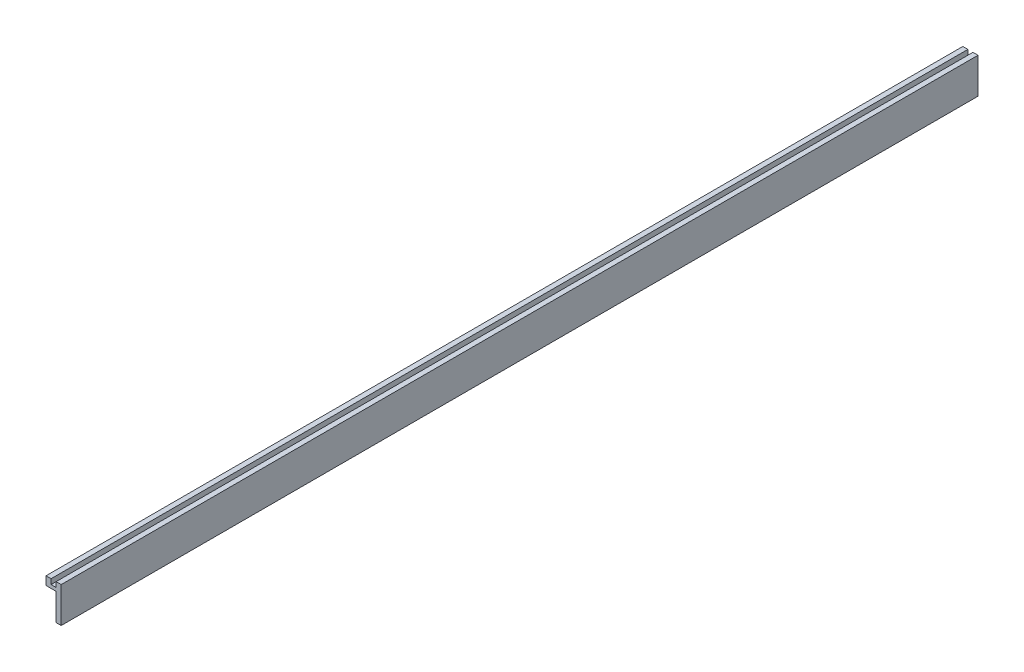
ISO-10303-21;
HEADER;
FILE_DESCRIPTION(('STEP AP214'),'2;1');
FILE_NAME('part.step','',(''),(''),'','','');
FILE_SCHEMA(('AUTOMOTIVE_DESIGN { 1 0 10303 214 1 1 1 1 }'));
ENDSEC;
DATA;
#1=APPLICATION_CONTEXT('core data for automotive mechanical design processes');
#2=APPLICATION_PROTOCOL_DEFINITION('international standard','automotive_design',2000,#1);
#3=PRODUCT_CONTEXT('',#1,'mechanical');
#4=PRODUCT('Part','Part','',(#3));
#5=PRODUCT_RELATED_PRODUCT_CATEGORY('part','',(#4));
#6=PRODUCT_DEFINITION_FORMATION('','',#4);
#7=PRODUCT_DEFINITION_CONTEXT('part definition',#1,'design');
#8=PRODUCT_DEFINITION('design','',#6,#7);
#9=PRODUCT_DEFINITION_SHAPE('','',#8);
#10=(LENGTH_UNIT() NAMED_UNIT(*) SI_UNIT(.MILLI.,.METRE.));
#11=(NAMED_UNIT(*) PLANE_ANGLE_UNIT() SI_UNIT($,.RADIAN.));
#12=(NAMED_UNIT(*) SI_UNIT($,.STERADIAN.) SOLID_ANGLE_UNIT());
#13=UNCERTAINTY_MEASURE_WITH_UNIT(LENGTH_MEASURE(1.E-05),#10,'distance_accuracy_value','');
#14=(GEOMETRIC_REPRESENTATION_CONTEXT(3) GLOBAL_UNCERTAINTY_ASSIGNED_CONTEXT((#13)) GLOBAL_UNIT_ASSIGNED_CONTEXT((#10,
#11,#12)) REPRESENTATION_CONTEXT('',''));
#15=CARTESIAN_POINT('',(0.,0.,0.));
#16=DIRECTION('',(0.,0.,1.));
#17=DIRECTION('',(1.,0.,0.));
#18=AXIS2_PLACEMENT_3D('',#15,#16,#17);
#19=CARTESIAN_POINT('',(0.,0.,904.));
#20=DIRECTION('',(0.,1.,0.));
#21=DIRECTION('',(0.,0.,1.));
#22=AXIS2_PLACEMENT_3D('',#19,#20,#21);
#23=PLANE('',#22);
#24=DIRECTION('',(0.,0.,1.));
#25=VECTOR('',#24,1.);
#26=CARTESIAN_POINT('',(10.,0.,0.));
#27=LINE('',#26,#25);
#28=CARTESIAN_POINT('',(10.,0.,0.));
#29=VERTEX_POINT('',#28);
#30=CARTESIAN_POINT('',(10.,0.,904.));
#31=VERTEX_POINT('',#30);
#32=EDGE_CURVE('E235',#29,#31,#27,.T.);
#33=ORIENTED_EDGE('',*,*,#32,.F.);
#34=DIRECTION('',(1.,0.,0.));
#35=VECTOR('',#34,1.);
#36=CARTESIAN_POINT('',(0.,0.,0.));
#37=LINE('',#36,#35);
#38=CARTESIAN_POINT('',(15.,0.,0.));
#39=VERTEX_POINT('',#38);
#40=EDGE_CURVE('E158',#29,#39,#37,.T.);
#41=ORIENTED_EDGE('',*,*,#40,.T.);
#42=DIRECTION('',(0.,0.,-1.));
#43=VECTOR('',#42,1.);
#44=CARTESIAN_POINT('',(15.,0.,904.));
#45=LINE('',#44,#43);
#46=CARTESIAN_POINT('',(15.,0.,904.));
#47=VERTEX_POINT('',#46);
#48=EDGE_CURVE('E11',#47,#39,#45,.T.);
#49=ORIENTED_EDGE('',*,*,#48,.F.);
#50=DIRECTION('',(1.,0.,0.));
#51=VECTOR('',#50,1.);
#52=CARTESIAN_POINT('',(0.,0.,904.));
#53=LINE('',#52,#51);
#54=EDGE_CURVE('E108',#31,#47,#53,.T.);
#55=ORIENTED_EDGE('',*,*,#54,.F.);
#56=EDGE_LOOP('',(#33,#41,#49,#55));
#57=FACE_BOUND('',#56,.T.);
#58=ADVANCED_FACE('F45',(#57),#23,.F.);
#59=CARTESIAN_POINT('',(0.,0.,904.));
#60=DIRECTION('',(1.,0.,0.));
#61=DIRECTION('',(0.,0.,-1.));
#62=AXIS2_PLACEMENT_3D('',#59,#60,#61);
#63=PLANE('',#62);
#64=DIRECTION('',(0.,-1.,0.));
#65=VECTOR('',#64,1.);
#66=CARTESIAN_POINT('',(0.,0.,0.));
#67=LINE('',#66,#65);
#68=CARTESIAN_POINT('',(0.,35.,0.));
#69=VERTEX_POINT('',#68);
#70=CARTESIAN_POINT('',(0.,26.6744169741884,0.));
#71=VERTEX_POINT('',#70);
#72=EDGE_CURVE('E154',#69,#71,#67,.T.);
#73=ORIENTED_EDGE('',*,*,#72,.T.);
#74=DIRECTION('',(0.,0.,-1.));
#75=VECTOR('',#74,1.);
#76=CARTESIAN_POINT('',(0.,26.6744169741884,0.));
#77=LINE('',#76,#75);
#78=CARTESIAN_POINT('',(0.,26.6744169741884,904.));
#79=VERTEX_POINT('',#78);
#80=EDGE_CURVE('E224',#79,#71,#77,.T.);
#81=ORIENTED_EDGE('',*,*,#80,.F.);
#82=DIRECTION('',(0.,-1.,0.));
#83=VECTOR('',#82,1.);
#84=CARTESIAN_POINT('',(0.,0.,904.));
#85=LINE('',#84,#83);
#86=CARTESIAN_POINT('',(0.,35.,904.));
#87=VERTEX_POINT('',#86);
#88=EDGE_CURVE('E178',#87,#79,#85,.T.);
#89=ORIENTED_EDGE('',*,*,#88,.F.);
#90=DIRECTION('',(0.,0.,-1.));
#91=VECTOR('',#90,1.);
#92=CARTESIAN_POINT('',(0.,35.,904.));
#93=LINE('',#92,#91);
#94=EDGE_CURVE('E150',#87,#69,#93,.T.);
#95=ORIENTED_EDGE('',*,*,#94,.T.);
#96=EDGE_LOOP('',(#73,#81,#89,#95));
#97=FACE_BOUND('',#96,.T.);
#98=ADVANCED_FACE('F47',(#97),#63,.F.);
#99=CARTESIAN_POINT('',(15.,0.,904.));
#100=DIRECTION('',(-1.,0.,0.));
#101=DIRECTION('',(0.,0.,1.));
#102=AXIS2_PLACEMENT_3D('',#99,#100,#101);
#103=PLANE('',#102);
#104=DIRECTION('',(0.,1.,0.));
#105=VECTOR('',#104,1.);
#106=CARTESIAN_POINT('',(15.,0.,0.));
#107=LINE('',#106,#105);
#108=CARTESIAN_POINT('',(15.,35.,0.));
#109=VERTEX_POINT('',#108);
#110=EDGE_CURVE('E162',#39,#109,#107,.T.);
#111=ORIENTED_EDGE('',*,*,#110,.T.);
#112=DIRECTION('',(0.,0.,-1.));
#113=VECTOR('',#112,1.);
#114=CARTESIAN_POINT('',(15.,35.,904.));
#115=LINE('',#114,#113);
#116=CARTESIAN_POINT('',(15.,35.,904.));
#117=VERTEX_POINT('',#116);
#118=EDGE_CURVE('E54',#117,#109,#115,.T.);
#119=ORIENTED_EDGE('',*,*,#118,.F.);
#120=DIRECTION('',(0.,1.,0.));
#121=VECTOR('',#120,1.);
#122=CARTESIAN_POINT('',(15.,0.,904.));
#123=LINE('',#122,#121);
#124=EDGE_CURVE('E209',#47,#117,#123,.T.);
#125=ORIENTED_EDGE('',*,*,#124,.F.);
#126=ORIENTED_EDGE('',*,*,#48,.T.);
#127=EDGE_LOOP('',(#111,#119,#125,#126));
#128=FACE_BOUND('',#127,.T.);
#129=ADVANCED_FACE('F290',(#128),#103,.F.);
#130=CARTESIAN_POINT('',(10.,35.,904.));
#131=DIRECTION('',(0.,-1.,0.));
#132=DIRECTION('',(0.,0.,-1.));
#133=AXIS2_PLACEMENT_3D('',#130,#131,#132);
#134=PLANE('',#133);
#135=DIRECTION('',(-1.,0.,0.));
#136=VECTOR('',#135,1.);
#137=CARTESIAN_POINT('',(10.,35.,0.));
#138=LINE('',#137,#136);
#139=CARTESIAN_POINT('',(10.,35.,0.));
#140=VERTEX_POINT('',#139);
#141=EDGE_CURVE('E165',#109,#140,#138,.T.);
#142=ORIENTED_EDGE('',*,*,#141,.T.);
#143=DIRECTION('',(0.,0.,-1.));
#144=VECTOR('',#143,1.);
#145=CARTESIAN_POINT('',(10.,35.,904.));
#146=LINE('',#145,#144);
#147=CARTESIAN_POINT('',(10.,35.,904.));
#148=VERTEX_POINT('',#147);
#149=EDGE_CURVE('E185',#148,#140,#146,.T.);
#150=ORIENTED_EDGE('',*,*,#149,.F.);
#151=DIRECTION('',(-1.,0.,0.));
#152=VECTOR('',#151,1.);
#153=CARTESIAN_POINT('',(10.,35.,904.));
#154=LINE('',#153,#152);
#155=EDGE_CURVE('E196',#117,#148,#154,.T.);
#156=ORIENTED_EDGE('',*,*,#155,.F.);
#157=ORIENTED_EDGE('',*,*,#118,.T.);
#158=EDGE_LOOP('',(#142,#150,#156,#157));
#159=FACE_BOUND('',#158,.T.);
#160=ADVANCED_FACE('F194',(#159),#134,.F.);
#161=CARTESIAN_POINT('',(10.,30.,904.));
#162=DIRECTION('',(1.,0.,0.));
#163=DIRECTION('',(0.,0.,-1.));
#164=AXIS2_PLACEMENT_3D('',#161,#162,#163);
#165=PLANE('',#164);
#166=DIRECTION('',(0.,-1.,0.));
#167=VECTOR('',#166,1.);
#168=CARTESIAN_POINT('',(10.,30.,0.));
#169=LINE('',#168,#167);
#170=CARTESIAN_POINT('',(10.,30.,0.));
#171=VERTEX_POINT('',#170);
#172=EDGE_CURVE('E168',#140,#171,#169,.T.);
#173=ORIENTED_EDGE('',*,*,#172,.T.);
#174=DIRECTION('',(0.,0.,-1.));
#175=VECTOR('',#174,1.);
#176=CARTESIAN_POINT('',(10.,30.,904.));
#177=LINE('',#176,#175);
#178=CARTESIAN_POINT('',(10.,30.,904.));
#179=VERTEX_POINT('',#178);
#180=EDGE_CURVE('E143',#179,#171,#177,.T.);
#181=ORIENTED_EDGE('',*,*,#180,.F.);
#182=DIRECTION('',(0.,-1.,0.));
#183=VECTOR('',#182,1.);
#184=CARTESIAN_POINT('',(10.,30.,904.));
#185=LINE('',#184,#183);
#186=EDGE_CURVE('E129',#148,#179,#185,.T.);
#187=ORIENTED_EDGE('',*,*,#186,.F.);
#188=ORIENTED_EDGE('',*,*,#149,.T.);
#189=EDGE_LOOP('',(#173,#181,#187,#188));
#190=FACE_BOUND('',#189,.T.);
#191=ADVANCED_FACE('F206',(#190),#165,.F.);
#192=CARTESIAN_POINT('',(5.,30.,904.));
#193=DIRECTION('',(0.,-1.,0.));
#194=DIRECTION('',(0.,0.,-1.));
#195=AXIS2_PLACEMENT_3D('',#192,#193,#194);
#196=PLANE('',#195);
#197=DIRECTION('',(-1.,0.,0.));
#198=VECTOR('',#197,1.);
#199=CARTESIAN_POINT('',(5.,30.,0.));
#200=LINE('',#199,#198);
#201=CARTESIAN_POINT('',(5.,30.,0.));
#202=VERTEX_POINT('',#201);
#203=EDGE_CURVE('E139',#171,#202,#200,.T.);
#204=ORIENTED_EDGE('',*,*,#203,.T.);
#205=DIRECTION('',(0.,0.,-1.));
#206=VECTOR('',#205,1.);
#207=CARTESIAN_POINT('',(5.,30.,904.));
#208=LINE('',#207,#206);
#209=CARTESIAN_POINT('',(5.,30.,904.));
#210=VERTEX_POINT('',#209);
#211=EDGE_CURVE('E136',#210,#202,#208,.T.);
#212=ORIENTED_EDGE('',*,*,#211,.F.);
#213=DIRECTION('',(-1.,0.,0.));
#214=VECTOR('',#213,1.);
#215=CARTESIAN_POINT('',(5.,30.,904.));
#216=LINE('',#215,#214);
#217=EDGE_CURVE('E122',#179,#210,#216,.T.);
#218=ORIENTED_EDGE('',*,*,#217,.F.);
#219=ORIENTED_EDGE('',*,*,#180,.T.);
#220=EDGE_LOOP('',(#204,#212,#218,#219));
#221=FACE_BOUND('',#220,.T.);
#222=ADVANCED_FACE('F137',(#221),#196,.F.);
#223=CARTESIAN_POINT('',(5.,35.,904.));
#224=DIRECTION('',(-1.,0.,0.));
#225=DIRECTION('',(0.,0.,1.));
#226=AXIS2_PLACEMENT_3D('',#223,#224,#225);
#227=PLANE('',#226);
#228=DIRECTION('',(0.,1.,0.));
#229=VECTOR('',#228,1.);
#230=CARTESIAN_POINT('',(5.,35.,0.));
#231=LINE('',#230,#229);
#232=CARTESIAN_POINT('',(5.,35.,0.));
#233=VERTEX_POINT('',#232);
#234=EDGE_CURVE('E173',#202,#233,#231,.T.);
#235=ORIENTED_EDGE('',*,*,#234,.T.);
#236=DIRECTION('',(0.,0.,-1.));
#237=VECTOR('',#236,1.);
#238=CARTESIAN_POINT('',(5.,35.,904.));
#239=LINE('',#238,#237);
#240=CARTESIAN_POINT('',(5.,35.,904.));
#241=VERTEX_POINT('',#240);
#242=EDGE_CURVE('E144',#241,#233,#239,.T.);
#243=ORIENTED_EDGE('',*,*,#242,.F.);
#244=DIRECTION('',(0.,1.,0.));
#245=VECTOR('',#244,1.);
#246=CARTESIAN_POINT('',(5.,35.,904.));
#247=LINE('',#246,#245);
#248=EDGE_CURVE('E126',#210,#241,#247,.T.);
#249=ORIENTED_EDGE('',*,*,#248,.F.);
#250=ORIENTED_EDGE('',*,*,#211,.T.);
#251=EDGE_LOOP('',(#235,#243,#249,#250));
#252=FACE_BOUND('',#251,.T.);
#253=ADVANCED_FACE('F146',(#252),#227,.F.);
#254=CARTESIAN_POINT('',(0.,35.,904.));
#255=DIRECTION('',(0.,-1.,0.));
#256=DIRECTION('',(0.,0.,-1.));
#257=AXIS2_PLACEMENT_3D('',#254,#255,#256);
#258=PLANE('',#257);
#259=DIRECTION('',(-1.,0.,0.));
#260=VECTOR('',#259,1.);
#261=CARTESIAN_POINT('',(0.,35.,0.));
#262=LINE('',#261,#260);
#263=EDGE_CURVE('E100',#233,#69,#262,.T.);
#264=ORIENTED_EDGE('',*,*,#263,.T.);
#265=ORIENTED_EDGE('',*,*,#94,.F.);
#266=DIRECTION('',(-1.,0.,0.));
#267=VECTOR('',#266,1.);
#268=CARTESIAN_POINT('',(0.,35.,904.));
#269=LINE('',#268,#267);
#270=EDGE_CURVE('E70',#241,#87,#269,.T.);
#271=ORIENTED_EDGE('',*,*,#270,.F.);
#272=ORIENTED_EDGE('',*,*,#242,.T.);
#273=EDGE_LOOP('',(#264,#265,#271,#272));
#274=FACE_BOUND('',#273,.T.);
#275=ADVANCED_FACE('F276',(#274),#258,.F.);
#276=CARTESIAN_POINT('',(0.,0.,904.));
#277=DIRECTION('',(0.,0.,-1.));
#278=DIRECTION('',(-1.,0.,0.));
#279=AXIS2_PLACEMENT_3D('',#276,#277,#278);
#280=PLANE('',#279);
#281=ORIENTED_EDGE('',*,*,#88,.T.);
#282=DIRECTION('',(-1.,0.,0.));
#283=VECTOR('',#282,1.);
#284=CARTESIAN_POINT('',(10.,26.6744169741884,904.));
#285=LINE('',#284,#283);
#286=CARTESIAN_POINT('',(10.,26.6744169741884,904.));
#287=VERTEX_POINT('',#286);
#288=EDGE_CURVE('E218',#287,#79,#285,.T.);
#289=ORIENTED_EDGE('',*,*,#288,.F.);
#290=DIRECTION('',(0.,1.,0.));
#291=VECTOR('',#290,1.);
#292=CARTESIAN_POINT('',(10.,26.6744169741884,904.));
#293=LINE('',#292,#291);
#294=EDGE_CURVE('E232',#31,#287,#293,.T.);
#295=ORIENTED_EDGE('',*,*,#294,.F.);
#296=ORIENTED_EDGE('',*,*,#54,.T.);
#297=ORIENTED_EDGE('',*,*,#124,.T.);
#298=ORIENTED_EDGE('',*,*,#155,.T.);
#299=ORIENTED_EDGE('',*,*,#186,.T.);
#300=ORIENTED_EDGE('',*,*,#217,.T.);
#301=ORIENTED_EDGE('',*,*,#248,.T.);
#302=ORIENTED_EDGE('',*,*,#270,.T.);
#303=EDGE_LOOP('',(#281,#289,#295,#296,#297,#298,#299,#300,#301,#302));
#304=FACE_BOUND('',#303,.T.);
#305=ADVANCED_FACE('F124',(#304),#280,.F.);
#306=CARTESIAN_POINT('',(0.,0.,0.));
#307=DIRECTION('',(0.,0.,-1.));
#308=DIRECTION('',(-1.,0.,0.));
#309=AXIS2_PLACEMENT_3D('',#306,#307,#308);
#310=PLANE('',#309);
#311=DIRECTION('',(-1.,0.,0.));
#312=VECTOR('',#311,1.);
#313=CARTESIAN_POINT('',(10.,26.6744169741884,0.));
#314=LINE('',#313,#312);
#315=CARTESIAN_POINT('',(10.,26.6744169741884,0.));
#316=VERTEX_POINT('',#315);
#317=EDGE_CURVE('E159',#316,#71,#314,.T.);
#318=ORIENTED_EDGE('',*,*,#317,.T.);
#319=ORIENTED_EDGE('',*,*,#72,.F.);
#320=ORIENTED_EDGE('',*,*,#263,.F.);
#321=ORIENTED_EDGE('',*,*,#234,.F.);
#322=ORIENTED_EDGE('',*,*,#203,.F.);
#323=ORIENTED_EDGE('',*,*,#172,.F.);
#324=ORIENTED_EDGE('',*,*,#141,.F.);
#325=ORIENTED_EDGE('',*,*,#110,.F.);
#326=ORIENTED_EDGE('',*,*,#40,.F.);
#327=DIRECTION('',(0.,-1.,0.));
#328=VECTOR('',#327,1.);
#329=CARTESIAN_POINT('',(10.,26.6744169741884,0.));
#330=LINE('',#329,#328);
#331=EDGE_CURVE('E228',#316,#29,#330,.T.);
#332=ORIENTED_EDGE('',*,*,#331,.F.);
#333=EDGE_LOOP('',(#318,#319,#320,#321,#322,#323,#324,#325,#326,#332));
#334=FACE_BOUND('',#333,.T.);
#335=ADVANCED_FACE('F203',(#334),#310,.T.);
#336=CARTESIAN_POINT('',(10.,26.6744169741884,0.));
#337=DIRECTION('',(0.,1.,0.));
#338=DIRECTION('',(0.,0.,1.));
#339=AXIS2_PLACEMENT_3D('',#336,#337,#338);
#340=PLANE('',#339);
#341=ORIENTED_EDGE('',*,*,#80,.T.);
#342=ORIENTED_EDGE('',*,*,#317,.F.);
#343=DIRECTION('',(0.,0.,-1.));
#344=VECTOR('',#343,1.);
#345=CARTESIAN_POINT('',(10.,26.6744169741884,0.));
#346=LINE('',#345,#344);
#347=EDGE_CURVE('E61',#287,#316,#346,.T.);
#348=ORIENTED_EDGE('',*,*,#347,.F.);
#349=ORIENTED_EDGE('',*,*,#288,.T.);
#350=EDGE_LOOP('',(#341,#342,#348,#349));
#351=FACE_BOUND('',#350,.T.);
#352=ADVANCED_FACE('F259',(#351),#340,.F.);
#353=CARTESIAN_POINT('',(10.,0.,0.));
#354=DIRECTION('',(-1.,0.,0.));
#355=DIRECTION('',(0.,0.,1.));
#356=AXIS2_PLACEMENT_3D('',#353,#354,#355);
#357=PLANE('',#356);
#358=CARTESIAN_POINT('',(10.,12.5,304.));
#359=DIRECTION('',(-1.,0.,0.));
#360=DIRECTION('',(0.,0.,1.));
#361=AXIS2_PLACEMENT_3D('',#358,#359,#360);
#362=CIRCLE('',#361,4.99999999999999);
#363=CARTESIAN_POINT('',(10.,12.5,309.));
#364=VERTEX_POINT('',#363);
#365=EDGE_CURVE('E241',#364,#364,#362,.T.);
#366=ORIENTED_EDGE('',*,*,#365,.F.);
#367=EDGE_LOOP('',(#366));
#368=FACE_BOUND('',#367,.T.);
#369=ORIENTED_EDGE('',*,*,#331,.T.);
#370=ORIENTED_EDGE('',*,*,#32,.T.);
#371=ORIENTED_EDGE('',*,*,#294,.T.);
#372=ORIENTED_EDGE('',*,*,#347,.T.);
#373=EDGE_LOOP('',(#369,#370,#371,#372));
#374=FACE_BOUND('',#373,.T.);
#375=ADVANCED_FACE('F254',(#368,#374),#357,.T.);
#376=CARTESIAN_POINT('',(5.,12.5,304.));
#377=DIRECTION('',(1.,0.,0.));
#378=DIRECTION('',(0.,0.,-1.));
#379=AXIS2_PLACEMENT_3D('',#376,#377,#378);
#380=CYLINDRICAL_SURFACE('',#379,4.99999999999999);
#381=CARTESIAN_POINT('',(5.,12.5,304.));
#382=DIRECTION('',(-1.,0.,0.));
#383=DIRECTION('',(0.,0.,1.));
#384=AXIS2_PLACEMENT_3D('',#381,#382,#383);
#385=CIRCLE('',#384,4.99999999999999);
#386=CARTESIAN_POINT('',(5.,12.5,309.));
#387=VERTEX_POINT('',#386);
#388=EDGE_CURVE('E229',#387,#387,#385,.T.);
#389=ORIENTED_EDGE('',*,*,#388,.F.);
#390=EDGE_LOOP('',(#389));
#391=FACE_BOUND('',#390,.T.);
#392=ORIENTED_EDGE('',*,*,#365,.T.);
#393=EDGE_LOOP('',(#392));
#394=FACE_BOUND('',#393,.T.);
#395=ADVANCED_FACE('F251',(#391,#394),#380,.T.);
#396=CARTESIAN_POINT('',(5.,12.5,304.));
#397=DIRECTION('',(-1.,0.,0.));
#398=DIRECTION('',(0.,0.,1.));
#399=AXIS2_PLACEMENT_3D('',#396,#397,#398);
#400=PLANE('',#399);
#401=ORIENTED_EDGE('',*,*,#388,.T.);
#402=EDGE_LOOP('',(#401));
#403=FACE_BOUND('',#402,.T.);
#404=ADVANCED_FACE('F249',(#403),#400,.T.);
#405=CLOSED_SHELL('',(#58,#98,#129,#160,#191,#222,#253,#275,#305,#335,#352,#375,#395,#404));
#406=MANIFOLD_SOLID_BREP('B2',#405);
#407=ADVANCED_BREP_SHAPE_REPRESENTATION('',(#18,#406),#14);
#408=SHAPE_DEFINITION_REPRESENTATION(#9,#407);
ENDSEC;
END-ISO-10303-21;
